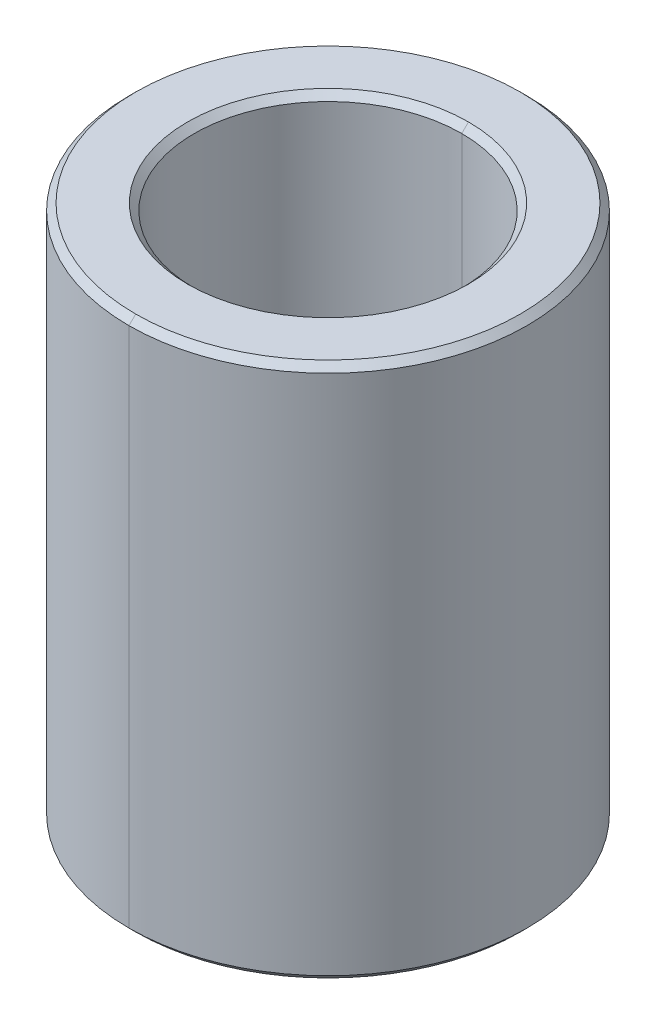
ISO-10303-21;
HEADER;
FILE_DESCRIPTION(('STEP AP214'),'2;1');
FILE_NAME('part.step','',(''),(''),'','','');
FILE_SCHEMA(('AUTOMOTIVE_DESIGN { 1 0 10303 214 1 1 1 1 }'));
ENDSEC;
DATA;
#1=APPLICATION_CONTEXT('core data for automotive mechanical design processes');
#2=APPLICATION_PROTOCOL_DEFINITION('international standard','automotive_design',2000,#1);
#3=PRODUCT_CONTEXT('',#1,'mechanical');
#4=PRODUCT('Part','Part','',(#3));
#5=PRODUCT_RELATED_PRODUCT_CATEGORY('part','',(#4));
#6=PRODUCT_DEFINITION_FORMATION('','',#4);
#7=PRODUCT_DEFINITION_CONTEXT('part definition',#1,'design');
#8=PRODUCT_DEFINITION('design','',#6,#7);
#9=PRODUCT_DEFINITION_SHAPE('','',#8);
#10=(LENGTH_UNIT() NAMED_UNIT(*) SI_UNIT(.MILLI.,.METRE.));
#11=(NAMED_UNIT(*) PLANE_ANGLE_UNIT() SI_UNIT($,.RADIAN.));
#12=(NAMED_UNIT(*) SI_UNIT($,.STERADIAN.) SOLID_ANGLE_UNIT());
#13=UNCERTAINTY_MEASURE_WITH_UNIT(LENGTH_MEASURE(1.E-05),#10,'distance_accuracy_value','');
#14=(GEOMETRIC_REPRESENTATION_CONTEXT(3) GLOBAL_UNCERTAINTY_ASSIGNED_CONTEXT((#13)) GLOBAL_UNIT_ASSIGNED_CONTEXT((#10,
#11,#12)) REPRESENTATION_CONTEXT('',''));
#15=CARTESIAN_POINT('',(0.,0.,0.));
#16=DIRECTION('',(0.,0.,1.));
#17=DIRECTION('',(1.,0.,0.));
#18=AXIS2_PLACEMENT_3D('',#15,#16,#17);
#19=CARTESIAN_POINT('',(0.,3.9,0.));
#20=DIRECTION('',(0.,1.,0.));
#21=DIRECTION('',(0.,0.,1.));
#22=AXIS2_PLACEMENT_3D('',#19,#20,#21);
#23=CONICAL_SURFACE('',#22,2.,0.785398163397448);
#24=DIRECTION('',(0.,0.707106781186548,-0.707106781186548));
#25=VECTOR('',#24,1.);
#26=CARTESIAN_POINT('',(0.,3.9,-2.));
#27=LINE('',#26,#25);
#28=CARTESIAN_POINT('',(0.,3.9,-2.));
#29=VERTEX_POINT('',#28);
#30=CARTESIAN_POINT('',(0.,4.,-2.1));
#31=VERTEX_POINT('',#30);
#32=EDGE_CURVE('E202',#29,#31,#27,.T.);
#33=ORIENTED_EDGE('',*,*,#32,.F.);
#34=CARTESIAN_POINT('',(0.,3.9,0.));
#35=DIRECTION('',(0.,1.,0.));
#36=DIRECTION('',(0.,0.,1.));
#37=AXIS2_PLACEMENT_3D('',#34,#35,#36);
#38=CIRCLE('',#37,2.);
#39=CARTESIAN_POINT('',(0.,3.9,2.));
#40=VERTEX_POINT('',#39);
#41=EDGE_CURVE('E24',#40,#29,#38,.T.);
#42=ORIENTED_EDGE('',*,*,#41,.F.);
#43=DIRECTION('',(0.,0.707106781186548,0.707106781186548));
#44=VECTOR('',#43,1.);
#45=CARTESIAN_POINT('',(0.,3.9,2.));
#46=LINE('',#45,#44);
#47=CARTESIAN_POINT('',(0.,4.,2.1));
#48=VERTEX_POINT('',#47);
#49=EDGE_CURVE('E210',#40,#48,#46,.T.);
#50=ORIENTED_EDGE('',*,*,#49,.T.);
#51=CARTESIAN_POINT('',(0.,4.,0.));
#52=DIRECTION('',(0.,-1.,0.));
#53=DIRECTION('',(0.,0.,1.));
#54=AXIS2_PLACEMENT_3D('',#51,#52,#53);
#55=CIRCLE('',#54,2.1);
#56=EDGE_CURVE('E116',#31,#48,#55,.T.);
#57=ORIENTED_EDGE('',*,*,#56,.F.);
#58=EDGE_LOOP('',(#33,#42,#50,#57));
#59=FACE_BOUND('',#58,.T.);
#60=ADVANCED_FACE('F16',(#59),#23,.F.);
#61=CARTESIAN_POINT('',(0.,-4.,0.));
#62=DIRECTION('',(0.,-1.,0.));
#63=DIRECTION('',(0.,0.,-1.));
#64=AXIS2_PLACEMENT_3D('',#61,#62,#63);
#65=CONICAL_SURFACE('',#64,2.1,0.785398163397443);
#66=DIRECTION('',(0.,-0.707106781186551,0.707106781186545));
#67=VECTOR('',#66,1.);
#68=CARTESIAN_POINT('',(0.,-4.,2.1));
#69=LINE('',#68,#67);
#70=CARTESIAN_POINT('',(0.,-3.9,2.));
#71=VERTEX_POINT('',#70);
#72=CARTESIAN_POINT('',(0.,-4.,2.1));
#73=VERTEX_POINT('',#72);
#74=EDGE_CURVE('E218',#71,#73,#69,.T.);
#75=ORIENTED_EDGE('',*,*,#74,.F.);
#76=CARTESIAN_POINT('',(0.,-3.9,0.));
#77=DIRECTION('',(0.,-1.,0.));
#78=DIRECTION('',(0.,0.,1.));
#79=AXIS2_PLACEMENT_3D('',#76,#77,#78);
#80=CIRCLE('',#79,2.);
#81=CARTESIAN_POINT('',(0.,-3.9,-2.));
#82=VERTEX_POINT('',#81);
#83=EDGE_CURVE('E10',#82,#71,#80,.T.);
#84=ORIENTED_EDGE('',*,*,#83,.F.);
#85=DIRECTION('',(0.,-0.707106781186551,-0.707106781186545));
#86=VECTOR('',#85,1.);
#87=CARTESIAN_POINT('',(0.,-4.,-2.1));
#88=LINE('',#87,#86);
#89=CARTESIAN_POINT('',(0.,-4.,-2.1));
#90=VERTEX_POINT('',#89);
#91=EDGE_CURVE('E129',#82,#90,#88,.T.);
#92=ORIENTED_EDGE('',*,*,#91,.T.);
#93=CARTESIAN_POINT('',(0.,-4.,0.));
#94=DIRECTION('',(0.,1.,0.));
#95=DIRECTION('',(0.,0.,1.));
#96=AXIS2_PLACEMENT_3D('',#93,#94,#95);
#97=CIRCLE('',#96,2.1);
#98=EDGE_CURVE('E177',#73,#90,#97,.T.);
#99=ORIENTED_EDGE('',*,*,#98,.F.);
#100=EDGE_LOOP('',(#75,#84,#92,#99));
#101=FACE_BOUND('',#100,.T.);
#102=ADVANCED_FACE('F234',(#101),#65,.F.);
#103=CARTESIAN_POINT('',(0.,4.,0.));
#104=DIRECTION('',(0.,-1.,0.));
#105=DIRECTION('',(0.,0.,-1.));
#106=AXIS2_PLACEMENT_3D('',#103,#104,#105);
#107=CONICAL_SURFACE('',#106,2.875,0.78539816339744);
#108=DIRECTION('',(0.,-0.707106781186554,0.707106781186542));
#109=VECTOR('',#108,1.);
#110=CARTESIAN_POINT('',(0.,4.,2.875));
#111=LINE('',#110,#109);
#112=CARTESIAN_POINT('',(0.,4.,2.875));
#113=VERTEX_POINT('',#112);
#114=CARTESIAN_POINT('',(0.,3.9,2.975));
#115=VERTEX_POINT('',#114);
#116=EDGE_CURVE('E111',#113,#115,#111,.T.);
#117=ORIENTED_EDGE('',*,*,#116,.F.);
#118=CARTESIAN_POINT('',(0.,4.,0.));
#119=DIRECTION('',(0.,1.,0.));
#120=DIRECTION('',(0.,0.,1.));
#121=AXIS2_PLACEMENT_3D('',#118,#119,#120);
#122=CIRCLE('',#121,2.875);
#123=CARTESIAN_POINT('',(0.,4.,-2.875));
#124=VERTEX_POINT('',#123);
#125=EDGE_CURVE('E105',#124,#113,#122,.T.);
#126=ORIENTED_EDGE('',*,*,#125,.F.);
#127=DIRECTION('',(0.,-0.707106781186554,-0.707106781186542));
#128=VECTOR('',#127,1.);
#129=CARTESIAN_POINT('',(0.,4.,-2.875));
#130=LINE('',#129,#128);
#131=CARTESIAN_POINT('',(0.,3.9,-2.975));
#132=VERTEX_POINT('',#131);
#133=EDGE_CURVE('E108',#124,#132,#130,.T.);
#134=ORIENTED_EDGE('',*,*,#133,.T.);
#135=CARTESIAN_POINT('',(0.,3.9,0.));
#136=DIRECTION('',(0.,-1.,0.));
#137=DIRECTION('',(0.,0.,1.));
#138=AXIS2_PLACEMENT_3D('',#135,#136,#137);
#139=CIRCLE('',#138,2.975);
#140=EDGE_CURVE('E148',#115,#132,#139,.T.);
#141=ORIENTED_EDGE('',*,*,#140,.F.);
#142=EDGE_LOOP('',(#117,#126,#134,#141));
#143=FACE_BOUND('',#142,.T.);
#144=ADVANCED_FACE('F107',(#143),#107,.T.);
#145=CARTESIAN_POINT('',(0.,-3.9,0.));
#146=DIRECTION('',(0.,1.,0.));
#147=DIRECTION('',(0.,0.,1.));
#148=AXIS2_PLACEMENT_3D('',#145,#146,#147);
#149=CONICAL_SURFACE('',#148,2.975,0.78539816339744);
#150=DIRECTION('',(0.,0.707106781186554,-0.707106781186542));
#151=VECTOR('',#150,1.);
#152=CARTESIAN_POINT('',(0.,-3.9,-2.975));
#153=LINE('',#152,#151);
#154=CARTESIAN_POINT('',(0.,-4.,-2.875));
#155=VERTEX_POINT('',#154);
#156=CARTESIAN_POINT('',(0.,-3.9,-2.975));
#157=VERTEX_POINT('',#156);
#158=EDGE_CURVE('E152',#155,#157,#153,.T.);
#159=ORIENTED_EDGE('',*,*,#158,.F.);
#160=CARTESIAN_POINT('',(0.,-4.,0.));
#161=DIRECTION('',(0.,-1.,0.));
#162=DIRECTION('',(0.,0.,1.));
#163=AXIS2_PLACEMENT_3D('',#160,#161,#162);
#164=CIRCLE('',#163,2.875);
#165=CARTESIAN_POINT('',(0.,-4.,2.875));
#166=VERTEX_POINT('',#165);
#167=EDGE_CURVE('E174',#166,#155,#164,.T.);
#168=ORIENTED_EDGE('',*,*,#167,.F.);
#169=DIRECTION('',(0.,0.707106781186554,0.707106781186542));
#170=VECTOR('',#169,1.);
#171=CARTESIAN_POINT('',(0.,-3.9,2.975));
#172=LINE('',#171,#170);
#173=CARTESIAN_POINT('',(0.,-3.9,2.975));
#174=VERTEX_POINT('',#173);
#175=EDGE_CURVE('E156',#166,#174,#172,.T.);
#176=ORIENTED_EDGE('',*,*,#175,.T.);
#177=CARTESIAN_POINT('',(0.,-3.9,0.));
#178=DIRECTION('',(0.,1.,0.));
#179=DIRECTION('',(0.,0.,1.));
#180=AXIS2_PLACEMENT_3D('',#177,#178,#179);
#181=CIRCLE('',#180,2.975);
#182=EDGE_CURVE('E37',#157,#174,#181,.T.);
#183=ORIENTED_EDGE('',*,*,#182,.F.);
#184=EDGE_LOOP('',(#159,#168,#176,#183));
#185=FACE_BOUND('',#184,.T.);
#186=ADVANCED_FACE('F243',(#185),#149,.T.);
#187=CARTESIAN_POINT('',(0.,4.,0.));
#188=DIRECTION('',(0.,-1.,0.));
#189=DIRECTION('',(0.,0.,-1.));
#190=AXIS2_PLACEMENT_3D('',#187,#188,#189);
#191=CYLINDRICAL_SURFACE('',#190,2.);
#192=DIRECTION('',(0.,-1.,0.));
#193=VECTOR('',#192,1.);
#194=CARTESIAN_POINT('',(0.,4.,2.));
#195=LINE('',#194,#193);
#196=EDGE_CURVE('E159',#40,#71,#195,.T.);
#197=ORIENTED_EDGE('',*,*,#196,.F.);
#198=ORIENTED_EDGE('',*,*,#41,.T.);
#199=DIRECTION('',(0.,-1.,0.));
#200=VECTOR('',#199,1.);
#201=CARTESIAN_POINT('',(0.,4.,-2.));
#202=LINE('',#201,#200);
#203=EDGE_CURVE('E163',#29,#82,#202,.T.);
#204=ORIENTED_EDGE('',*,*,#203,.T.);
#205=ORIENTED_EDGE('',*,*,#83,.T.);
#206=EDGE_LOOP('',(#197,#198,#204,#205));
#207=FACE_BOUND('',#206,.T.);
#208=ADVANCED_FACE('F187',(#207),#191,.F.);
#209=CARTESIAN_POINT('',(0.,4.,0.));
#210=DIRECTION('',(0.,-1.,0.));
#211=DIRECTION('',(0.,0.,-1.));
#212=AXIS2_PLACEMENT_3D('',#209,#210,#211);
#213=CYLINDRICAL_SURFACE('',#212,2.975);
#214=DIRECTION('',(0.,-1.,0.));
#215=VECTOR('',#214,1.);
#216=CARTESIAN_POINT('',(0.,4.,2.975));
#217=LINE('',#216,#215);
#218=EDGE_CURVE('E167',#115,#174,#217,.T.);
#219=ORIENTED_EDGE('',*,*,#218,.F.);
#220=ORIENTED_EDGE('',*,*,#140,.T.);
#221=DIRECTION('',(0.,-1.,0.));
#222=VECTOR('',#221,1.);
#223=CARTESIAN_POINT('',(0.,4.,-2.975));
#224=LINE('',#223,#222);
#225=EDGE_CURVE('E117',#132,#157,#224,.T.);
#226=ORIENTED_EDGE('',*,*,#225,.T.);
#227=ORIENTED_EDGE('',*,*,#182,.T.);
#228=EDGE_LOOP('',(#219,#220,#226,#227));
#229=FACE_BOUND('',#228,.T.);
#230=ADVANCED_FACE('F239',(#229),#213,.T.);
#231=CARTESIAN_POINT('',(0.,-4.,0.));
#232=DIRECTION('',(0.,1.,0.));
#233=DIRECTION('',(1.,0.,0.));
#234=AXIS2_PLACEMENT_3D('',#231,#232,#233);
#235=PLANE('',#234);
#236=CARTESIAN_POINT('',(0.,-4.,0.));
#237=DIRECTION('',(0.,1.,0.));
#238=DIRECTION('',(0.,0.,1.));
#239=AXIS2_PLACEMENT_3D('',#236,#237,#238);
#240=CIRCLE('',#239,2.1);
#241=EDGE_CURVE('E139',#90,#73,#240,.T.);
#242=ORIENTED_EDGE('',*,*,#241,.T.);
#243=ORIENTED_EDGE('',*,*,#98,.T.);
#244=EDGE_LOOP('',(#242,#243));
#245=FACE_BOUND('',#244,.T.);
#246=ORIENTED_EDGE('',*,*,#167,.T.);
#247=CARTESIAN_POINT('',(0.,-4.,0.));
#248=DIRECTION('',(0.,-1.,0.));
#249=DIRECTION('',(0.,0.,1.));
#250=AXIS2_PLACEMENT_3D('',#247,#248,#249);
#251=CIRCLE('',#250,2.875);
#252=EDGE_CURVE('E125',#155,#166,#251,.T.);
#253=ORIENTED_EDGE('',*,*,#252,.T.);
#254=EDGE_LOOP('',(#246,#253));
#255=FACE_BOUND('',#254,.T.);
#256=ADVANCED_FACE('F236',(#245,#255),#235,.F.);
#257=CARTESIAN_POINT('',(0.,4.,0.));
#258=DIRECTION('',(0.,1.,0.));
#259=DIRECTION('',(1.,0.,0.));
#260=AXIS2_PLACEMENT_3D('',#257,#258,#259);
#261=PLANE('',#260);
#262=CARTESIAN_POINT('',(0.,4.,0.));
#263=DIRECTION('',(0.,-1.,0.));
#264=DIRECTION('',(0.,0.,1.));
#265=AXIS2_PLACEMENT_3D('',#262,#263,#264);
#266=CIRCLE('',#265,2.1);
#267=EDGE_CURVE('E207',#48,#31,#266,.T.);
#268=ORIENTED_EDGE('',*,*,#267,.T.);
#269=ORIENTED_EDGE('',*,*,#56,.T.);
#270=EDGE_LOOP('',(#268,#269));
#271=FACE_BOUND('',#270,.T.);
#272=ORIENTED_EDGE('',*,*,#125,.T.);
#273=CARTESIAN_POINT('',(0.,4.,0.));
#274=DIRECTION('',(0.,1.,0.));
#275=DIRECTION('',(0.,0.,1.));
#276=AXIS2_PLACEMENT_3D('',#273,#274,#275);
#277=CIRCLE('',#276,2.875);
#278=EDGE_CURVE('E121',#113,#124,#277,.T.);
#279=ORIENTED_EDGE('',*,*,#278,.T.);
#280=EDGE_LOOP('',(#272,#279));
#281=FACE_BOUND('',#280,.T.);
#282=ADVANCED_FACE('F127',(#271,#281),#261,.T.);
#283=CARTESIAN_POINT('',(0.,4.,0.));
#284=DIRECTION('',(0.,-1.,0.));
#285=DIRECTION('',(0.,0.,-1.));
#286=AXIS2_PLACEMENT_3D('',#283,#284,#285);
#287=CYLINDRICAL_SURFACE('',#286,2.975);
#288=CARTESIAN_POINT('',(0.,3.9,0.));
#289=DIRECTION('',(0.,-1.,0.));
#290=DIRECTION('',(0.,0.,1.));
#291=AXIS2_PLACEMENT_3D('',#288,#289,#290);
#292=CIRCLE('',#291,2.975);
#293=EDGE_CURVE('E123',#132,#115,#292,.T.);
#294=ORIENTED_EDGE('',*,*,#293,.T.);
#295=ORIENTED_EDGE('',*,*,#218,.T.);
#296=CARTESIAN_POINT('',(0.,-3.9,0.));
#297=DIRECTION('',(0.,1.,0.));
#298=DIRECTION('',(0.,0.,1.));
#299=AXIS2_PLACEMENT_3D('',#296,#297,#298);
#300=CIRCLE('',#299,2.975);
#301=EDGE_CURVE('E143',#174,#157,#300,.T.);
#302=ORIENTED_EDGE('',*,*,#301,.T.);
#303=ORIENTED_EDGE('',*,*,#225,.F.);
#304=EDGE_LOOP('',(#294,#295,#302,#303));
#305=FACE_BOUND('',#304,.T.);
#306=ADVANCED_FACE('F319',(#305),#287,.T.);
#307=CARTESIAN_POINT('',(0.,4.,0.));
#308=DIRECTION('',(0.,-1.,0.));
#309=DIRECTION('',(0.,0.,-1.));
#310=AXIS2_PLACEMENT_3D('',#307,#308,#309);
#311=CYLINDRICAL_SURFACE('',#310,2.);
#312=CARTESIAN_POINT('',(0.,3.9,0.));
#313=DIRECTION('',(0.,1.,0.));
#314=DIRECTION('',(0.,0.,1.));
#315=AXIS2_PLACEMENT_3D('',#312,#313,#314);
#316=CIRCLE('',#315,2.);
#317=EDGE_CURVE('E198',#29,#40,#316,.T.);
#318=ORIENTED_EDGE('',*,*,#317,.T.);
#319=ORIENTED_EDGE('',*,*,#196,.T.);
#320=CARTESIAN_POINT('',(0.,-3.9,0.));
#321=DIRECTION('',(0.,-1.,0.));
#322=DIRECTION('',(0.,0.,1.));
#323=AXIS2_PLACEMENT_3D('',#320,#321,#322);
#324=CIRCLE('',#323,2.);
#325=EDGE_CURVE('E200',#71,#82,#324,.T.);
#326=ORIENTED_EDGE('',*,*,#325,.T.);
#327=ORIENTED_EDGE('',*,*,#203,.F.);
#328=EDGE_LOOP('',(#318,#319,#326,#327));
#329=FACE_BOUND('',#328,.T.);
#330=ADVANCED_FACE('F196',(#329),#311,.F.);
#331=CARTESIAN_POINT('',(0.,-3.9,0.));
#332=DIRECTION('',(0.,1.,0.));
#333=DIRECTION('',(0.,0.,1.));
#334=AXIS2_PLACEMENT_3D('',#331,#332,#333);
#335=CONICAL_SURFACE('',#334,2.975,0.78539816339744);
#336=ORIENTED_EDGE('',*,*,#252,.F.);
#337=ORIENTED_EDGE('',*,*,#158,.T.);
#338=ORIENTED_EDGE('',*,*,#301,.F.);
#339=ORIENTED_EDGE('',*,*,#175,.F.);
#340=EDGE_LOOP('',(#336,#337,#338,#339));
#341=FACE_BOUND('',#340,.T.);
#342=ADVANCED_FACE('F246',(#341),#335,.T.);
#343=CARTESIAN_POINT('',(0.,4.,0.));
#344=DIRECTION('',(0.,-1.,0.));
#345=DIRECTION('',(0.,0.,-1.));
#346=AXIS2_PLACEMENT_3D('',#343,#344,#345);
#347=CONICAL_SURFACE('',#346,2.875,0.78539816339744);
#348=ORIENTED_EDGE('',*,*,#278,.F.);
#349=ORIENTED_EDGE('',*,*,#116,.T.);
#350=ORIENTED_EDGE('',*,*,#293,.F.);
#351=ORIENTED_EDGE('',*,*,#133,.F.);
#352=EDGE_LOOP('',(#348,#349,#350,#351));
#353=FACE_BOUND('',#352,.T.);
#354=ADVANCED_FACE('F120',(#353),#347,.T.);
#355=CARTESIAN_POINT('',(0.,-4.,0.));
#356=DIRECTION('',(0.,-1.,0.));
#357=DIRECTION('',(0.,0.,-1.));
#358=AXIS2_PLACEMENT_3D('',#355,#356,#357);
#359=CONICAL_SURFACE('',#358,2.1,0.785398163397443);
#360=ORIENTED_EDGE('',*,*,#325,.F.);
#361=ORIENTED_EDGE('',*,*,#74,.T.);
#362=ORIENTED_EDGE('',*,*,#241,.F.);
#363=ORIENTED_EDGE('',*,*,#91,.F.);
#364=EDGE_LOOP('',(#360,#361,#362,#363));
#365=FACE_BOUND('',#364,.T.);
#366=ADVANCED_FACE('F232',(#365),#359,.F.);
#367=CARTESIAN_POINT('',(0.,3.9,0.));
#368=DIRECTION('',(0.,1.,0.));
#369=DIRECTION('',(0.,0.,1.));
#370=AXIS2_PLACEMENT_3D('',#367,#368,#369);
#371=CONICAL_SURFACE('',#370,2.,0.785398163397448);
#372=ORIENTED_EDGE('',*,*,#317,.F.);
#373=ORIENTED_EDGE('',*,*,#32,.T.);
#374=ORIENTED_EDGE('',*,*,#267,.F.);
#375=ORIENTED_EDGE('',*,*,#49,.F.);
#376=EDGE_LOOP('',(#372,#373,#374,#375));
#377=FACE_BOUND('',#376,.T.);
#378=ADVANCED_FACE('F209',(#377),#371,.F.);
#379=CLOSED_SHELL('',(#60,#102,#144,#186,#208,#230,#256,#282,#306,#330,#342,#354,#366,#378));
#380=MANIFOLD_SOLID_BREP('B1',#379);
#381=ADVANCED_BREP_SHAPE_REPRESENTATION('',(#18,#380),#14);
#382=SHAPE_DEFINITION_REPRESENTATION(#9,#381);
ENDSEC;
END-ISO-10303-21;
